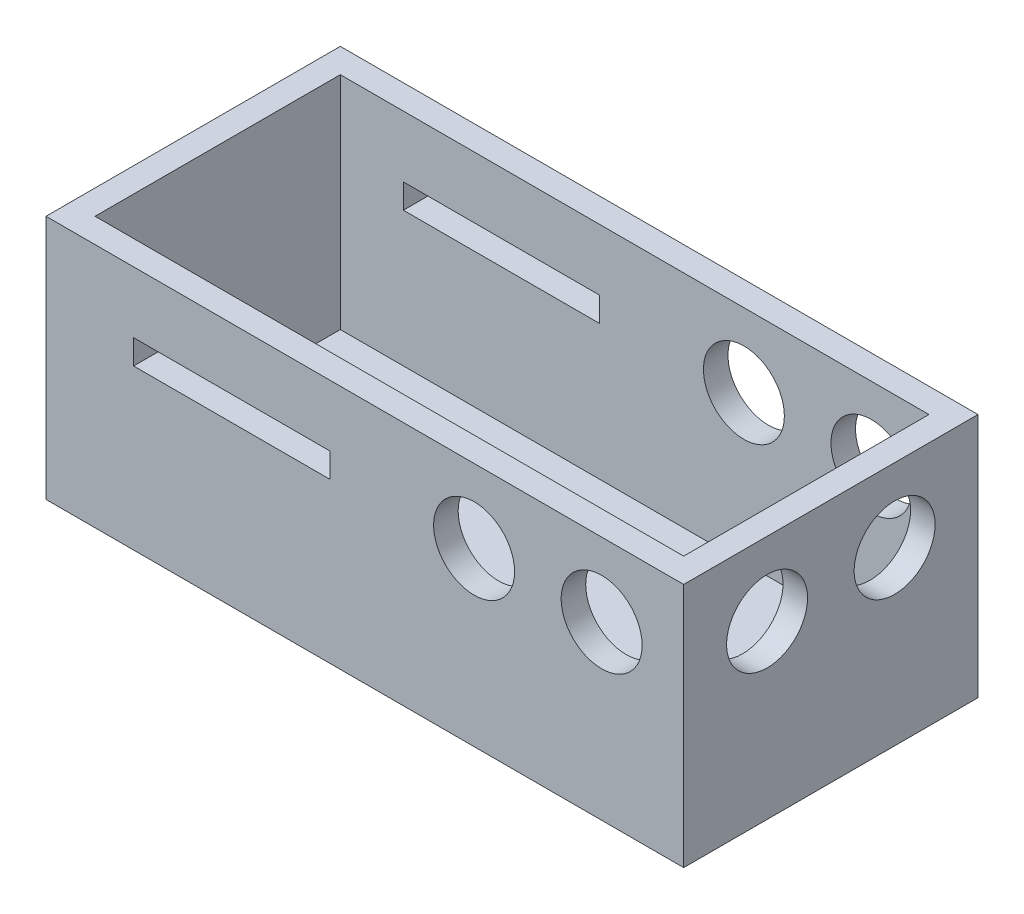
ISO-10303-21;
HEADER;
FILE_DESCRIPTION(('STEP AP214'),'2;1');
FILE_NAME('part.step','',(''),(''),'','','');
FILE_SCHEMA(('AUTOMOTIVE_DESIGN { 1 0 10303 214 1 1 1 1 }'));
ENDSEC;
DATA;
#1=APPLICATION_CONTEXT('core data for automotive mechanical design processes');
#2=APPLICATION_PROTOCOL_DEFINITION('international standard','automotive_design',2000,#1);
#3=PRODUCT_CONTEXT('',#1,'mechanical');
#4=PRODUCT('Part','Part','',(#3));
#5=PRODUCT_RELATED_PRODUCT_CATEGORY('part','',(#4));
#6=PRODUCT_DEFINITION_FORMATION('','',#4);
#7=PRODUCT_DEFINITION_CONTEXT('part definition',#1,'design');
#8=PRODUCT_DEFINITION('design','',#6,#7);
#9=PRODUCT_DEFINITION_SHAPE('','',#8);
#10=(LENGTH_UNIT() NAMED_UNIT(*) SI_UNIT(.MILLI.,.METRE.));
#11=(NAMED_UNIT(*) PLANE_ANGLE_UNIT() SI_UNIT($,.RADIAN.));
#12=(NAMED_UNIT(*) SI_UNIT($,.STERADIAN.) SOLID_ANGLE_UNIT());
#13=UNCERTAINTY_MEASURE_WITH_UNIT(LENGTH_MEASURE(1.E-05),#10,'distance_accuracy_value','');
#14=(GEOMETRIC_REPRESENTATION_CONTEXT(3) GLOBAL_UNCERTAINTY_ASSIGNED_CONTEXT((#13)) GLOBAL_UNIT_ASSIGNED_CONTEXT((#10,
#11,#12)) REPRESENTATION_CONTEXT('',''));
#15=CARTESIAN_POINT('',(0.,0.,0.));
#16=DIRECTION('',(0.,0.,1.));
#17=DIRECTION('',(1.,0.,0.));
#18=AXIS2_PLACEMENT_3D('',#15,#16,#17);
#19=CARTESIAN_POINT('',(-65.,50.,30.));
#20=DIRECTION('',(1.,0.,0.));
#21=DIRECTION('',(0.,0.,-1.));
#22=AXIS2_PLACEMENT_3D('',#19,#20,#21);
#23=PLANE('',#22);
#24=DIRECTION('',(0.,0.,1.));
#25=VECTOR('',#24,1.);
#26=CARTESIAN_POINT('',(-65.,0.,30.));
#27=LINE('',#26,#25);
#28=CARTESIAN_POINT('',(-65.,0.,-30.));
#29=VERTEX_POINT('',#28);
#30=CARTESIAN_POINT('',(-65.,0.,30.));
#31=VERTEX_POINT('',#30);
#32=EDGE_CURVE('E238',#29,#31,#27,.T.);
#33=ORIENTED_EDGE('',*,*,#32,.T.);
#34=DIRECTION('',(0.,-1.,0.));
#35=VECTOR('',#34,1.);
#36=CARTESIAN_POINT('',(-65.,50.,30.));
#37=LINE('',#36,#35);
#38=CARTESIAN_POINT('',(-65.,50.,30.));
#39=VERTEX_POINT('',#38);
#40=EDGE_CURVE('E288',#39,#31,#37,.T.);
#41=ORIENTED_EDGE('',*,*,#40,.F.);
#42=DIRECTION('',(0.,0.,1.));
#43=VECTOR('',#42,1.);
#44=CARTESIAN_POINT('',(-65.,50.,30.));
#45=LINE('',#44,#43);
#46=CARTESIAN_POINT('',(-65.,50.,-30.));
#47=VERTEX_POINT('',#46);
#48=EDGE_CURVE('E262',#47,#39,#45,.T.);
#49=ORIENTED_EDGE('',*,*,#48,.F.);
#50=DIRECTION('',(0.,-1.,0.));
#51=VECTOR('',#50,1.);
#52=CARTESIAN_POINT('',(-65.,50.,-30.));
#53=LINE('',#52,#51);
#54=EDGE_CURVE('E272',#47,#29,#53,.T.);
#55=ORIENTED_EDGE('',*,*,#54,.T.);
#56=EDGE_LOOP('',(#33,#41,#49,#55));
#57=FACE_BOUND('',#56,.T.);
#58=ADVANCED_FACE('F33',(#57),#23,.F.);
#59=CARTESIAN_POINT('',(65.,50.,30.));
#60=DIRECTION('',(0.,0.,-1.));
#61=DIRECTION('',(-1.,0.,0.));
#62=AXIS2_PLACEMENT_3D('',#59,#60,#61);
#63=PLANE('',#62);
#64=DIRECTION('',(1.,0.,0.));
#65=VECTOR('',#64,1.);
#66=CARTESIAN_POINT('',(-7.14067208269808,37.5,30.));
#67=LINE('',#66,#65);
#68=CARTESIAN_POINT('',(-47.1406720826981,37.5,30.));
#69=VERTEX_POINT('',#68);
#70=CARTESIAN_POINT('',(-7.14067208269808,37.5,30.));
#71=VERTEX_POINT('',#70);
#72=EDGE_CURVE('E169',#69,#71,#67,.T.);
#73=ORIENTED_EDGE('',*,*,#72,.T.);
#74=DIRECTION('',(0.,-1.,0.));
#75=VECTOR('',#74,1.);
#76=CARTESIAN_POINT('',(-7.14067208269808,37.5,30.));
#77=LINE('',#76,#75);
#78=CARTESIAN_POINT('',(-7.14067208269808,32.5,30.));
#79=VERTEX_POINT('',#78);
#80=EDGE_CURVE('E151',#71,#79,#77,.T.);
#81=ORIENTED_EDGE('',*,*,#80,.T.);
#82=DIRECTION('',(-1.,0.,0.));
#83=VECTOR('',#82,1.);
#84=CARTESIAN_POINT('',(-7.14067208269808,32.5,30.));
#85=LINE('',#84,#83);
#86=CARTESIAN_POINT('',(-47.1406720826981,32.5,30.));
#87=VERTEX_POINT('',#86);
#88=EDGE_CURVE('E161',#79,#87,#85,.T.);
#89=ORIENTED_EDGE('',*,*,#88,.T.);
#90=DIRECTION('',(0.,1.,0.));
#91=VECTOR('',#90,1.);
#92=CARTESIAN_POINT('',(-47.1406720826981,37.5,30.));
#93=LINE('',#92,#91);
#94=EDGE_CURVE('E47',#87,#69,#93,.T.);
#95=ORIENTED_EDGE('',*,*,#94,.T.);
#96=EDGE_LOOP('',(#73,#81,#89,#95));
#97=FACE_BOUND('',#96,.T.);
#98=CARTESIAN_POINT('',(48.2742436446079,35.,30.));
#99=DIRECTION('',(0.,0.,1.));
#100=DIRECTION('',(1.,0.,0.));
#101=AXIS2_PLACEMENT_3D('',#98,#99,#100);
#102=CIRCLE('',#101,8.25000000000001);
#103=CARTESIAN_POINT('',(56.5242436446079,35.,30.));
#104=VERTEX_POINT('',#103);
#105=EDGE_CURVE('E199',#104,#104,#102,.T.);
#106=ORIENTED_EDGE('',*,*,#105,.F.);
#107=EDGE_LOOP('',(#106));
#108=FACE_BOUND('',#107,.T.);
#109=CARTESIAN_POINT('',(22.2742436446078,35.,30.));
#110=DIRECTION('',(0.,0.,1.));
#111=DIRECTION('',(1.,0.,0.));
#112=AXIS2_PLACEMENT_3D('',#109,#110,#111);
#113=CIRCLE('',#112,8.25);
#114=CARTESIAN_POINT('',(30.5242436446078,35.,30.));
#115=VERTEX_POINT('',#114);
#116=EDGE_CURVE('E209',#115,#115,#113,.T.);
#117=ORIENTED_EDGE('',*,*,#116,.F.);
#118=EDGE_LOOP('',(#117));
#119=FACE_BOUND('',#118,.T.);
#120=DIRECTION('',(1.,0.,0.));
#121=VECTOR('',#120,1.);
#122=CARTESIAN_POINT('',(65.,0.,30.));
#123=LINE('',#122,#121);
#124=CARTESIAN_POINT('',(65.,0.,30.));
#125=VERTEX_POINT('',#124);
#126=EDGE_CURVE('E275',#31,#125,#123,.T.);
#127=ORIENTED_EDGE('',*,*,#126,.T.);
#128=DIRECTION('',(0.,-1.,0.));
#129=VECTOR('',#128,1.);
#130=CARTESIAN_POINT('',(65.,50.,30.));
#131=LINE('',#130,#129);
#132=CARTESIAN_POINT('',(65.,50.,30.));
#133=VERTEX_POINT('',#132);
#134=EDGE_CURVE('E285',#133,#125,#131,.T.);
#135=ORIENTED_EDGE('',*,*,#134,.F.);
#136=DIRECTION('',(1.,0.,0.));
#137=VECTOR('',#136,1.);
#138=CARTESIAN_POINT('',(65.,50.,30.));
#139=LINE('',#138,#137);
#140=EDGE_CURVE('E265',#39,#133,#139,.T.);
#141=ORIENTED_EDGE('',*,*,#140,.F.);
#142=ORIENTED_EDGE('',*,*,#40,.T.);
#143=EDGE_LOOP('',(#127,#135,#141,#142));
#144=FACE_BOUND('',#143,.T.);
#145=ADVANCED_FACE('F166',(#97,#108,#119,#144),#63,.F.);
#146=CARTESIAN_POINT('',(65.,50.,30.));
#147=DIRECTION('',(-1.,0.,0.));
#148=DIRECTION('',(0.,0.,1.));
#149=AXIS2_PLACEMENT_3D('',#146,#147,#148);
#150=PLANE('',#149);
#151=CARTESIAN_POINT('',(65.,35.,-13.));
#152=DIRECTION('',(1.,0.,0.));
#153=DIRECTION('',(0.,0.,-1.));
#154=AXIS2_PLACEMENT_3D('',#151,#152,#153);
#155=CIRCLE('',#154,8.25);
#156=CARTESIAN_POINT('',(65.,35.,-21.25));
#157=VERTEX_POINT('',#156);
#158=EDGE_CURVE('E220',#157,#157,#155,.T.);
#159=ORIENTED_EDGE('',*,*,#158,.F.);
#160=EDGE_LOOP('',(#159));
#161=FACE_BOUND('',#160,.T.);
#162=CARTESIAN_POINT('',(65.,35.,13.));
#163=DIRECTION('',(1.,0.,0.));
#164=DIRECTION('',(0.,0.,-1.));
#165=AXIS2_PLACEMENT_3D('',#162,#163,#164);
#166=CIRCLE('',#165,8.25);
#167=CARTESIAN_POINT('',(65.,35.,4.75));
#168=VERTEX_POINT('',#167);
#169=EDGE_CURVE('E226',#168,#168,#166,.T.);
#170=ORIENTED_EDGE('',*,*,#169,.F.);
#171=EDGE_LOOP('',(#170));
#172=FACE_BOUND('',#171,.T.);
#173=DIRECTION('',(0.,0.,-1.));
#174=VECTOR('',#173,1.);
#175=CARTESIAN_POINT('',(65.,0.,30.));
#176=LINE('',#175,#174);
#177=CARTESIAN_POINT('',(65.,0.,-30.));
#178=VERTEX_POINT('',#177);
#179=EDGE_CURVE('E277',#125,#178,#176,.T.);
#180=ORIENTED_EDGE('',*,*,#179,.T.);
#181=DIRECTION('',(0.,-1.,0.));
#182=VECTOR('',#181,1.);
#183=CARTESIAN_POINT('',(65.,50.,-30.));
#184=LINE('',#183,#182);
#185=CARTESIAN_POINT('',(65.,50.,-30.));
#186=VERTEX_POINT('',#185);
#187=EDGE_CURVE('E282',#186,#178,#184,.T.);
#188=ORIENTED_EDGE('',*,*,#187,.F.);
#189=DIRECTION('',(0.,0.,-1.));
#190=VECTOR('',#189,1.);
#191=CARTESIAN_POINT('',(65.,50.,30.));
#192=LINE('',#191,#190);
#193=EDGE_CURVE('E268',#133,#186,#192,.T.);
#194=ORIENTED_EDGE('',*,*,#193,.F.);
#195=ORIENTED_EDGE('',*,*,#134,.T.);
#196=EDGE_LOOP('',(#180,#188,#194,#195));
#197=FACE_BOUND('',#196,.T.);
#198=ADVANCED_FACE('F323',(#161,#172,#197),#150,.F.);
#199=CARTESIAN_POINT('',(65.,50.,-30.));
#200=DIRECTION('',(0.,0.,1.));
#201=DIRECTION('',(1.,0.,0.));
#202=AXIS2_PLACEMENT_3D('',#199,#200,#201);
#203=PLANE('',#202);
#204=DIRECTION('',(-1.,0.,0.));
#205=VECTOR('',#204,1.);
#206=CARTESIAN_POINT('',(-7.14067208269809,32.5,-30.));
#207=LINE('',#206,#205);
#208=CARTESIAN_POINT('',(-7.14067208269809,32.5,-30.));
#209=VERTEX_POINT('',#208);
#210=CARTESIAN_POINT('',(-47.1406720826981,32.5,-30.));
#211=VERTEX_POINT('',#210);
#212=EDGE_CURVE('E179',#209,#211,#207,.T.);
#213=ORIENTED_EDGE('',*,*,#212,.F.);
#214=DIRECTION('',(0.,-1.,0.));
#215=VECTOR('',#214,1.);
#216=CARTESIAN_POINT('',(-7.14067208269809,37.5,-30.));
#217=LINE('',#216,#215);
#218=CARTESIAN_POINT('',(-7.14067208269809,37.5,-30.));
#219=VERTEX_POINT('',#218);
#220=EDGE_CURVE('E55',#219,#209,#217,.T.);
#221=ORIENTED_EDGE('',*,*,#220,.F.);
#222=DIRECTION('',(1.,0.,0.));
#223=VECTOR('',#222,1.);
#224=CARTESIAN_POINT('',(-7.14067208269809,37.5,-30.));
#225=LINE('',#224,#223);
#226=CARTESIAN_POINT('',(-47.1406720826981,37.5,-30.));
#227=VERTEX_POINT('',#226);
#228=EDGE_CURVE('E170',#227,#219,#225,.T.);
#229=ORIENTED_EDGE('',*,*,#228,.F.);
#230=DIRECTION('',(0.,1.,0.));
#231=VECTOR('',#230,1.);
#232=CARTESIAN_POINT('',(-47.1406720826981,37.5,-30.));
#233=LINE('',#232,#231);
#234=EDGE_CURVE('E173',#211,#227,#233,.T.);
#235=ORIENTED_EDGE('',*,*,#234,.F.);
#236=EDGE_LOOP('',(#213,#221,#229,#235));
#237=FACE_BOUND('',#236,.T.);
#238=CARTESIAN_POINT('',(48.2742436446079,35.,-30.));
#239=DIRECTION('',(0.,0.,1.));
#240=DIRECTION('',(1.,0.,0.));
#241=AXIS2_PLACEMENT_3D('',#238,#239,#240);
#242=CIRCLE('',#241,8.25000000000001);
#243=CARTESIAN_POINT('',(56.5242436446079,35.,-30.));
#244=VERTEX_POINT('',#243);
#245=EDGE_CURVE('E200',#244,#244,#242,.T.);
#246=ORIENTED_EDGE('',*,*,#245,.T.);
#247=EDGE_LOOP('',(#246));
#248=FACE_BOUND('',#247,.T.);
#249=CARTESIAN_POINT('',(22.2742436446078,35.,-30.));
#250=DIRECTION('',(0.,0.,1.));
#251=DIRECTION('',(1.,0.,0.));
#252=AXIS2_PLACEMENT_3D('',#249,#250,#251);
#253=CIRCLE('',#252,8.25);
#254=CARTESIAN_POINT('',(30.5242436446078,35.,-30.));
#255=VERTEX_POINT('',#254);
#256=EDGE_CURVE('E210',#255,#255,#253,.T.);
#257=ORIENTED_EDGE('',*,*,#256,.T.);
#258=EDGE_LOOP('',(#257));
#259=FACE_BOUND('',#258,.T.);
#260=DIRECTION('',(-1.,0.,0.));
#261=VECTOR('',#260,1.);
#262=CARTESIAN_POINT('',(65.,0.,-30.));
#263=LINE('',#262,#261);
#264=EDGE_CURVE('E266',#178,#29,#263,.T.);
#265=ORIENTED_EDGE('',*,*,#264,.T.);
#266=ORIENTED_EDGE('',*,*,#54,.F.);
#267=DIRECTION('',(-1.,0.,0.));
#268=VECTOR('',#267,1.);
#269=CARTESIAN_POINT('',(65.,50.,-30.));
#270=LINE('',#269,#268);
#271=EDGE_CURVE('E270',#186,#47,#270,.T.);
#272=ORIENTED_EDGE('',*,*,#271,.F.);
#273=ORIENTED_EDGE('',*,*,#187,.T.);
#274=EDGE_LOOP('',(#265,#266,#272,#273));
#275=FACE_BOUND('',#274,.T.);
#276=ADVANCED_FACE('F319',(#237,#248,#259,#275),#203,.F.);
#277=CARTESIAN_POINT('',(0.,50.,0.));
#278=DIRECTION('',(0.,1.,0.));
#279=DIRECTION('',(0.,0.,1.));
#280=AXIS2_PLACEMENT_3D('',#277,#278,#279);
#281=PLANE('',#280);
#282=DIRECTION('',(0.,0.,1.));
#283=VECTOR('',#282,1.);
#284=CARTESIAN_POINT('',(-60.,50.,30.));
#285=LINE('',#284,#283);
#286=CARTESIAN_POINT('',(-60.,50.,-25.));
#287=VERTEX_POINT('',#286);
#288=CARTESIAN_POINT('',(-60.,50.,25.));
#289=VERTEX_POINT('',#288);
#290=EDGE_CURVE('E254',#287,#289,#285,.T.);
#291=ORIENTED_EDGE('',*,*,#290,.F.);
#292=DIRECTION('',(-1.,0.,0.));
#293=VECTOR('',#292,1.);
#294=CARTESIAN_POINT('',(65.,50.,-25.));
#295=LINE('',#294,#293);
#296=CARTESIAN_POINT('',(60.,50.,-25.));
#297=VERTEX_POINT('',#296);
#298=EDGE_CURVE('E244',#297,#287,#295,.T.);
#299=ORIENTED_EDGE('',*,*,#298,.F.);
#300=DIRECTION('',(0.,0.,-1.));
#301=VECTOR('',#300,1.);
#302=CARTESIAN_POINT('',(60.,50.,30.));
#303=LINE('',#302,#301);
#304=CARTESIAN_POINT('',(60.,50.,25.));
#305=VERTEX_POINT('',#304);
#306=EDGE_CURVE('E258',#305,#297,#303,.T.);
#307=ORIENTED_EDGE('',*,*,#306,.F.);
#308=DIRECTION('',(1.,0.,0.));
#309=VECTOR('',#308,1.);
#310=CARTESIAN_POINT('',(65.,50.,25.));
#311=LINE('',#310,#309);
#312=EDGE_CURVE('E256',#289,#305,#311,.T.);
#313=ORIENTED_EDGE('',*,*,#312,.F.);
#314=EDGE_LOOP('',(#291,#299,#307,#313));
#315=FACE_BOUND('',#314,.T.);
#316=ORIENTED_EDGE('',*,*,#48,.T.);
#317=ORIENTED_EDGE('',*,*,#140,.T.);
#318=ORIENTED_EDGE('',*,*,#193,.T.);
#319=ORIENTED_EDGE('',*,*,#271,.T.);
#320=EDGE_LOOP('',(#316,#317,#318,#319));
#321=FACE_BOUND('',#320,.T.);
#322=ADVANCED_FACE('F322',(#315,#321),#281,.T.);
#323=CARTESIAN_POINT('',(0.,0.,0.));
#324=DIRECTION('',(0.,1.,0.));
#325=DIRECTION('',(0.,0.,1.));
#326=AXIS2_PLACEMENT_3D('',#323,#324,#325);
#327=PLANE('',#326);
#328=ORIENTED_EDGE('',*,*,#32,.F.);
#329=ORIENTED_EDGE('',*,*,#264,.F.);
#330=ORIENTED_EDGE('',*,*,#179,.F.);
#331=ORIENTED_EDGE('',*,*,#126,.F.);
#332=EDGE_LOOP('',(#328,#329,#330,#331));
#333=FACE_BOUND('',#332,.T.);
#334=ADVANCED_FACE('F339',(#333),#327,.F.);
#335=CARTESIAN_POINT('',(-60.,50.,30.));
#336=DIRECTION('',(1.,0.,0.));
#337=DIRECTION('',(0.,0.,-1.));
#338=AXIS2_PLACEMENT_3D('',#335,#336,#337);
#339=PLANE('',#338);
#340=DIRECTION('',(0.,0.,1.));
#341=VECTOR('',#340,1.);
#342=CARTESIAN_POINT('',(-60.,5.,30.));
#343=LINE('',#342,#341);
#344=CARTESIAN_POINT('',(-60.,5.,-25.));
#345=VERTEX_POINT('',#344);
#346=CARTESIAN_POINT('',(-60.,5.,25.));
#347=VERTEX_POINT('',#346);
#348=EDGE_CURVE('E229',#345,#347,#343,.T.);
#349=ORIENTED_EDGE('',*,*,#348,.F.);
#350=DIRECTION('',(0.,-1.,0.));
#351=VECTOR('',#350,1.);
#352=CARTESIAN_POINT('',(-60.,50.,-25.));
#353=LINE('',#352,#351);
#354=EDGE_CURVE('E240',#287,#345,#353,.T.);
#355=ORIENTED_EDGE('',*,*,#354,.F.);
#356=ORIENTED_EDGE('',*,*,#290,.T.);
#357=DIRECTION('',(0.,-1.,0.));
#358=VECTOR('',#357,1.);
#359=CARTESIAN_POINT('',(-60.,50.,25.));
#360=LINE('',#359,#358);
#361=EDGE_CURVE('E235',#289,#347,#360,.T.);
#362=ORIENTED_EDGE('',*,*,#361,.T.);
#363=EDGE_LOOP('',(#349,#355,#356,#362));
#364=FACE_BOUND('',#363,.T.);
#365=ADVANCED_FACE('F387',(#364),#339,.T.);
#366=CARTESIAN_POINT('',(65.,50.,25.));
#367=DIRECTION('',(0.,0.,-1.));
#368=DIRECTION('',(-1.,0.,0.));
#369=AXIS2_PLACEMENT_3D('',#366,#367,#368);
#370=PLANE('',#369);
#371=DIRECTION('',(0.,-1.,0.));
#372=VECTOR('',#371,1.);
#373=CARTESIAN_POINT('',(-7.14067208269809,50.,25.));
#374=LINE('',#373,#372);
#375=CARTESIAN_POINT('',(-7.14067208269808,37.5,25.));
#376=VERTEX_POINT('',#375);
#377=CARTESIAN_POINT('',(-7.14067208269809,32.5,25.));
#378=VERTEX_POINT('',#377);
#379=EDGE_CURVE('E154',#376,#378,#374,.T.);
#380=ORIENTED_EDGE('',*,*,#379,.F.);
#381=DIRECTION('',(1.,0.,0.));
#382=VECTOR('',#381,1.);
#383=CARTESIAN_POINT('',(65.,37.5,25.));
#384=LINE('',#383,#382);
#385=CARTESIAN_POINT('',(-47.1406720826981,37.5,25.));
#386=VERTEX_POINT('',#385);
#387=EDGE_CURVE('E196',#386,#376,#384,.T.);
#388=ORIENTED_EDGE('',*,*,#387,.F.);
#389=DIRECTION('',(0.,1.,0.));
#390=VECTOR('',#389,1.);
#391=CARTESIAN_POINT('',(-47.1406720826981,50.,25.));
#392=LINE('',#391,#390);
#393=CARTESIAN_POINT('',(-47.1406720826981,32.5,25.));
#394=VERTEX_POINT('',#393);
#395=EDGE_CURVE('E194',#394,#386,#392,.T.);
#396=ORIENTED_EDGE('',*,*,#395,.F.);
#397=DIRECTION('',(-1.,0.,0.));
#398=VECTOR('',#397,1.);
#399=CARTESIAN_POINT('',(65.,32.5,25.));
#400=LINE('',#399,#398);
#401=EDGE_CURVE('E186',#378,#394,#400,.T.);
#402=ORIENTED_EDGE('',*,*,#401,.F.);
#403=EDGE_LOOP('',(#380,#388,#396,#402));
#404=FACE_BOUND('',#403,.T.);
#405=CARTESIAN_POINT('',(48.2742436446079,35.,25.));
#406=DIRECTION('',(0.,0.,-1.));
#407=DIRECTION('',(-1.,0.,0.));
#408=AXIS2_PLACEMENT_3D('',#405,#406,#407);
#409=CIRCLE('',#408,8.25000000000001);
#410=CARTESIAN_POINT('',(40.0242436446078,35.,25.));
#411=VERTEX_POINT('',#410);
#412=EDGE_CURVE('E206',#411,#411,#409,.T.);
#413=ORIENTED_EDGE('',*,*,#412,.F.);
#414=EDGE_LOOP('',(#413));
#415=FACE_BOUND('',#414,.T.);
#416=CARTESIAN_POINT('',(22.2742436446078,35.,25.));
#417=DIRECTION('',(0.,0.,-1.));
#418=DIRECTION('',(-1.,0.,0.));
#419=AXIS2_PLACEMENT_3D('',#416,#417,#418);
#420=CIRCLE('',#419,8.25);
#421=CARTESIAN_POINT('',(14.0242436446078,35.,25.));
#422=VERTEX_POINT('',#421);
#423=EDGE_CURVE('E216',#422,#422,#420,.T.);
#424=ORIENTED_EDGE('',*,*,#423,.F.);
#425=EDGE_LOOP('',(#424));
#426=FACE_BOUND('',#425,.T.);
#427=DIRECTION('',(1.,0.,0.));
#428=VECTOR('',#427,1.);
#429=CARTESIAN_POINT('',(65.,5.,25.));
#430=LINE('',#429,#428);
#431=CARTESIAN_POINT('',(60.,5.,25.));
#432=VERTEX_POINT('',#431);
#433=EDGE_CURVE('E234',#347,#432,#430,.T.);
#434=ORIENTED_EDGE('',*,*,#433,.F.);
#435=ORIENTED_EDGE('',*,*,#361,.F.);
#436=ORIENTED_EDGE('',*,*,#312,.T.);
#437=DIRECTION('',(0.,-1.,0.));
#438=VECTOR('',#437,1.);
#439=CARTESIAN_POINT('',(60.,50.,25.));
#440=LINE('',#439,#438);
#441=EDGE_CURVE('E239',#305,#432,#440,.T.);
#442=ORIENTED_EDGE('',*,*,#441,.T.);
#443=EDGE_LOOP('',(#434,#435,#436,#442));
#444=FACE_BOUND('',#443,.T.);
#445=ADVANCED_FACE('F381',(#404,#415,#426,#444),#370,.T.);
#446=CARTESIAN_POINT('',(60.,50.,30.));
#447=DIRECTION('',(-1.,0.,0.));
#448=DIRECTION('',(0.,0.,1.));
#449=AXIS2_PLACEMENT_3D('',#446,#447,#448);
#450=PLANE('',#449);
#451=CARTESIAN_POINT('',(60.,35.,-13.));
#452=DIRECTION('',(-1.,0.,0.));
#453=DIRECTION('',(0.,0.,1.));
#454=AXIS2_PLACEMENT_3D('',#451,#452,#453);
#455=CIRCLE('',#454,8.25);
#456=CARTESIAN_POINT('',(60.,35.,-4.75));
#457=VERTEX_POINT('',#456);
#458=EDGE_CURVE('E219',#457,#457,#455,.F.);
#459=ORIENTED_EDGE('',*,*,#458,.T.);
#460=EDGE_LOOP('',(#459));
#461=FACE_BOUND('',#460,.T.);
#462=CARTESIAN_POINT('',(60.,35.,13.));
#463=DIRECTION('',(-1.,0.,0.));
#464=DIRECTION('',(0.,0.,1.));
#465=AXIS2_PLACEMENT_3D('',#462,#463,#464);
#466=CIRCLE('',#465,8.25);
#467=CARTESIAN_POINT('',(60.,35.,21.25));
#468=VERTEX_POINT('',#467);
#469=EDGE_CURVE('E223',#468,#468,#466,.F.);
#470=ORIENTED_EDGE('',*,*,#469,.T.);
#471=EDGE_LOOP('',(#470));
#472=FACE_BOUND('',#471,.T.);
#473=DIRECTION('',(0.,0.,-1.));
#474=VECTOR('',#473,1.);
#475=CARTESIAN_POINT('',(60.,5.,30.));
#476=LINE('',#475,#474);
#477=CARTESIAN_POINT('',(60.,5.,-25.));
#478=VERTEX_POINT('',#477);
#479=EDGE_CURVE('E246',#432,#478,#476,.T.);
#480=ORIENTED_EDGE('',*,*,#479,.F.);
#481=ORIENTED_EDGE('',*,*,#441,.F.);
#482=ORIENTED_EDGE('',*,*,#306,.T.);
#483=DIRECTION('',(0.,-1.,0.));
#484=VECTOR('',#483,1.);
#485=CARTESIAN_POINT('',(60.,50.,-25.));
#486=LINE('',#485,#484);
#487=EDGE_CURVE('E243',#297,#478,#486,.T.);
#488=ORIENTED_EDGE('',*,*,#487,.T.);
#489=EDGE_LOOP('',(#480,#481,#482,#488));
#490=FACE_BOUND('',#489,.T.);
#491=ADVANCED_FACE('F386',(#461,#472,#490),#450,.T.);
#492=CARTESIAN_POINT('',(65.,50.,-25.));
#493=DIRECTION('',(0.,0.,1.));
#494=DIRECTION('',(1.,0.,0.));
#495=AXIS2_PLACEMENT_3D('',#492,#493,#494);
#496=PLANE('',#495);
#497=DIRECTION('',(0.,1.,0.));
#498=VECTOR('',#497,1.);
#499=CARTESIAN_POINT('',(-7.14067208269809,50.,-25.));
#500=LINE('',#499,#498);
#501=CARTESIAN_POINT('',(-7.14067208269809,32.5,-25.));
#502=VERTEX_POINT('',#501);
#503=CARTESIAN_POINT('',(-7.14067208269809,37.5,-25.));
#504=VERTEX_POINT('',#503);
#505=EDGE_CURVE('E11',#502,#504,#500,.T.);
#506=ORIENTED_EDGE('',*,*,#505,.F.);
#507=DIRECTION('',(1.,0.,0.));
#508=VECTOR('',#507,1.);
#509=CARTESIAN_POINT('',(65.,32.5,-25.));
#510=LINE('',#509,#508);
#511=CARTESIAN_POINT('',(-47.1406720826981,32.5,-25.));
#512=VERTEX_POINT('',#511);
#513=EDGE_CURVE('E291',#512,#502,#510,.T.);
#514=ORIENTED_EDGE('',*,*,#513,.F.);
#515=DIRECTION('',(0.,-1.,0.));
#516=VECTOR('',#515,1.);
#517=CARTESIAN_POINT('',(-47.1406720826981,50.,-25.));
#518=LINE('',#517,#516);
#519=CARTESIAN_POINT('',(-47.1406720826981,37.5,-25.));
#520=VERTEX_POINT('',#519);
#521=EDGE_CURVE('E297',#520,#512,#518,.T.);
#522=ORIENTED_EDGE('',*,*,#521,.F.);
#523=DIRECTION('',(-1.,0.,0.));
#524=VECTOR('',#523,1.);
#525=CARTESIAN_POINT('',(65.,37.5,-25.));
#526=LINE('',#525,#524);
#527=EDGE_CURVE('E40',#504,#520,#526,.T.);
#528=ORIENTED_EDGE('',*,*,#527,.F.);
#529=EDGE_LOOP('',(#506,#514,#522,#528));
#530=FACE_BOUND('',#529,.T.);
#531=CARTESIAN_POINT('',(48.2742436446079,35.,-25.));
#532=DIRECTION('',(0.,0.,1.));
#533=DIRECTION('',(1.,0.,0.));
#534=AXIS2_PLACEMENT_3D('',#531,#532,#533);
#535=CIRCLE('',#534,8.25000000000001);
#536=CARTESIAN_POINT('',(56.5242436446079,35.,-25.));
#537=VERTEX_POINT('',#536);
#538=EDGE_CURVE('E203',#537,#537,#535,.T.);
#539=ORIENTED_EDGE('',*,*,#538,.F.);
#540=EDGE_LOOP('',(#539));
#541=FACE_BOUND('',#540,.T.);
#542=CARTESIAN_POINT('',(22.2742436446078,35.,-25.));
#543=DIRECTION('',(0.,0.,1.));
#544=DIRECTION('',(1.,0.,0.));
#545=AXIS2_PLACEMENT_3D('',#542,#543,#544);
#546=CIRCLE('',#545,8.25);
#547=CARTESIAN_POINT('',(30.5242436446078,35.,-25.));
#548=VERTEX_POINT('',#547);
#549=EDGE_CURVE('E213',#548,#548,#546,.T.);
#550=ORIENTED_EDGE('',*,*,#549,.F.);
#551=EDGE_LOOP('',(#550));
#552=FACE_BOUND('',#551,.T.);
#553=DIRECTION('',(-1.,0.,0.));
#554=VECTOR('',#553,1.);
#555=CARTESIAN_POINT('',(65.,5.,-25.));
#556=LINE('',#555,#554);
#557=EDGE_CURVE('E250',#478,#345,#556,.T.);
#558=ORIENTED_EDGE('',*,*,#557,.F.);
#559=ORIENTED_EDGE('',*,*,#487,.F.);
#560=ORIENTED_EDGE('',*,*,#298,.T.);
#561=ORIENTED_EDGE('',*,*,#354,.T.);
#562=EDGE_LOOP('',(#558,#559,#560,#561));
#563=FACE_BOUND('',#562,.T.);
#564=ADVANCED_FACE('F312',(#530,#541,#552,#563),#496,.T.);
#565=CARTESIAN_POINT('',(0.,5.,0.));
#566=DIRECTION('',(0.,1.,0.));
#567=DIRECTION('',(0.,0.,1.));
#568=AXIS2_PLACEMENT_3D('',#565,#566,#567);
#569=PLANE('',#568);
#570=ORIENTED_EDGE('',*,*,#348,.T.);
#571=ORIENTED_EDGE('',*,*,#433,.T.);
#572=ORIENTED_EDGE('',*,*,#479,.T.);
#573=ORIENTED_EDGE('',*,*,#557,.T.);
#574=EDGE_LOOP('',(#570,#571,#572,#573));
#575=FACE_BOUND('',#574,.T.);
#576=ADVANCED_FACE('F401',(#575),#569,.T.);
#577=CARTESIAN_POINT('',(-65.001,35.,13.));
#578=DIRECTION('',(1.,0.,0.));
#579=DIRECTION('',(0.,0.,-1.));
#580=AXIS2_PLACEMENT_3D('',#577,#578,#579);
#581=CYLINDRICAL_SURFACE('',#580,8.25);
#582=ORIENTED_EDGE('',*,*,#469,.F.);
#583=EDGE_LOOP('',(#582));
#584=FACE_BOUND('',#583,.T.);
#585=ORIENTED_EDGE('',*,*,#169,.T.);
#586=EDGE_LOOP('',(#585));
#587=FACE_BOUND('',#586,.T.);
#588=ADVANCED_FACE('F483',(#584,#587),#581,.F.);
#589=CARTESIAN_POINT('',(-65.001,35.,-13.));
#590=DIRECTION('',(1.,0.,0.));
#591=DIRECTION('',(0.,0.,-1.));
#592=AXIS2_PLACEMENT_3D('',#589,#590,#591);
#593=CYLINDRICAL_SURFACE('',#592,8.25);
#594=ORIENTED_EDGE('',*,*,#458,.F.);
#595=EDGE_LOOP('',(#594));
#596=FACE_BOUND('',#595,.T.);
#597=ORIENTED_EDGE('',*,*,#158,.T.);
#598=EDGE_LOOP('',(#597));
#599=FACE_BOUND('',#598,.T.);
#600=ADVANCED_FACE('F479',(#596,#599),#593,.F.);
#601=CARTESIAN_POINT('',(22.2742436446078,35.,-30.));
#602=DIRECTION('',(0.,0.,1.));
#603=DIRECTION('',(1.,0.,0.));
#604=AXIS2_PLACEMENT_3D('',#601,#602,#603);
#605=CYLINDRICAL_SURFACE('',#604,8.25);
#606=ORIENTED_EDGE('',*,*,#549,.T.);
#607=EDGE_LOOP('',(#606));
#608=FACE_BOUND('',#607,.T.);
#609=ORIENTED_EDGE('',*,*,#256,.F.);
#610=EDGE_LOOP('',(#609));
#611=FACE_BOUND('',#610,.T.);
#612=ADVANCED_FACE('F476',(#608,#611),#605,.F.);
#613=ORIENTED_EDGE('',*,*,#423,.T.);
#614=EDGE_LOOP('',(#613));
#615=FACE_BOUND('',#614,.T.);
#616=ORIENTED_EDGE('',*,*,#116,.T.);
#617=EDGE_LOOP('',(#616));
#618=FACE_BOUND('',#617,.T.);
#619=ADVANCED_FACE('F474',(#615,#618),#605,.F.);
#620=CARTESIAN_POINT('',(48.2742436446079,35.,-30.));
#621=DIRECTION('',(0.,0.,1.));
#622=DIRECTION('',(1.,0.,0.));
#623=AXIS2_PLACEMENT_3D('',#620,#621,#622);
#624=CYLINDRICAL_SURFACE('',#623,8.25000000000001);
#625=ORIENTED_EDGE('',*,*,#538,.T.);
#626=EDGE_LOOP('',(#625));
#627=FACE_BOUND('',#626,.T.);
#628=ORIENTED_EDGE('',*,*,#245,.F.);
#629=EDGE_LOOP('',(#628));
#630=FACE_BOUND('',#629,.T.);
#631=ADVANCED_FACE('F471',(#627,#630),#624,.F.);
#632=ORIENTED_EDGE('',*,*,#412,.T.);
#633=EDGE_LOOP('',(#632));
#634=FACE_BOUND('',#633,.T.);
#635=ORIENTED_EDGE('',*,*,#105,.T.);
#636=EDGE_LOOP('',(#635));
#637=FACE_BOUND('',#636,.T.);
#638=ADVANCED_FACE('F368',(#634,#637),#624,.F.);
#639=CARTESIAN_POINT('',(-7.14067208269808,32.5,30.));
#640=DIRECTION('',(0.,-1.,0.));
#641=DIRECTION('',(0.,0.,-1.));
#642=AXIS2_PLACEMENT_3D('',#639,#640,#641);
#643=PLANE('',#642);
#644=ORIENTED_EDGE('',*,*,#513,.T.);
#645=DIRECTION('',(0.,0.,-1.));
#646=VECTOR('',#645,1.);
#647=CARTESIAN_POINT('',(-7.14067208269808,32.5,30.));
#648=LINE('',#647,#646);
#649=EDGE_CURVE('E158',#502,#209,#648,.T.);
#650=ORIENTED_EDGE('',*,*,#649,.T.);
#651=ORIENTED_EDGE('',*,*,#212,.T.);
#652=DIRECTION('',(0.,0.,-1.));
#653=VECTOR('',#652,1.);
#654=CARTESIAN_POINT('',(-47.1406720826981,32.5,30.));
#655=LINE('',#654,#653);
#656=EDGE_CURVE('E157',#512,#211,#655,.T.);
#657=ORIENTED_EDGE('',*,*,#656,.F.);
#658=EDGE_LOOP('',(#644,#650,#651,#657));
#659=FACE_BOUND('',#658,.T.);
#660=ADVANCED_FACE('F315',(#659),#643,.F.);
#661=CARTESIAN_POINT('',(-47.1406720826981,37.5,30.));
#662=DIRECTION('',(-1.,0.,0.));
#663=DIRECTION('',(0.,0.,1.));
#664=AXIS2_PLACEMENT_3D('',#661,#662,#663);
#665=PLANE('',#664);
#666=ORIENTED_EDGE('',*,*,#521,.T.);
#667=ORIENTED_EDGE('',*,*,#656,.T.);
#668=ORIENTED_EDGE('',*,*,#234,.T.);
#669=DIRECTION('',(0.,0.,-1.));
#670=VECTOR('',#669,1.);
#671=CARTESIAN_POINT('',(-47.1406720826981,37.5,30.));
#672=LINE('',#671,#670);
#673=EDGE_CURVE('E191',#520,#227,#672,.T.);
#674=ORIENTED_EDGE('',*,*,#673,.F.);
#675=EDGE_LOOP('',(#666,#667,#668,#674));
#676=FACE_BOUND('',#675,.T.);
#677=ADVANCED_FACE('F308',(#676),#665,.F.);
#678=CARTESIAN_POINT('',(-7.14067208269808,37.5,30.));
#679=DIRECTION('',(0.,1.,0.));
#680=DIRECTION('',(0.,0.,1.));
#681=AXIS2_PLACEMENT_3D('',#678,#679,#680);
#682=PLANE('',#681);
#683=ORIENTED_EDGE('',*,*,#527,.T.);
#684=ORIENTED_EDGE('',*,*,#673,.T.);
#685=ORIENTED_EDGE('',*,*,#228,.T.);
#686=DIRECTION('',(0.,0.,-1.));
#687=VECTOR('',#686,1.);
#688=CARTESIAN_POINT('',(-7.14067208269808,37.5,30.));
#689=LINE('',#688,#687);
#690=EDGE_CURVE('E187',#504,#219,#689,.T.);
#691=ORIENTED_EDGE('',*,*,#690,.F.);
#692=EDGE_LOOP('',(#683,#684,#685,#691));
#693=FACE_BOUND('',#692,.T.);
#694=ADVANCED_FACE('F303',(#693),#682,.F.);
#695=CARTESIAN_POINT('',(-7.14067208269808,37.5,30.));
#696=DIRECTION('',(1.,0.,0.));
#697=DIRECTION('',(0.,0.,-1.));
#698=AXIS2_PLACEMENT_3D('',#695,#696,#697);
#699=PLANE('',#698);
#700=ORIENTED_EDGE('',*,*,#505,.T.);
#701=ORIENTED_EDGE('',*,*,#690,.T.);
#702=ORIENTED_EDGE('',*,*,#220,.T.);
#703=ORIENTED_EDGE('',*,*,#649,.F.);
#704=EDGE_LOOP('',(#700,#701,#702,#703));
#705=FACE_BOUND('',#704,.T.);
#706=ADVANCED_FACE('F317',(#705),#699,.F.);
#707=ORIENTED_EDGE('',*,*,#379,.T.);
#708=EDGE_CURVE('E146',#79,#378,#648,.T.);
#709=ORIENTED_EDGE('',*,*,#708,.F.);
#710=ORIENTED_EDGE('',*,*,#80,.F.);
#711=EDGE_CURVE('E184',#71,#376,#689,.T.);
#712=ORIENTED_EDGE('',*,*,#711,.T.);
#713=EDGE_LOOP('',(#707,#709,#710,#712));
#714=FACE_BOUND('',#713,.T.);
#715=ADVANCED_FACE('F148',(#714),#699,.F.);
#716=ORIENTED_EDGE('',*,*,#387,.T.);
#717=ORIENTED_EDGE('',*,*,#711,.F.);
#718=ORIENTED_EDGE('',*,*,#72,.F.);
#719=EDGE_CURVE('E188',#69,#386,#672,.T.);
#720=ORIENTED_EDGE('',*,*,#719,.T.);
#721=EDGE_LOOP('',(#716,#717,#718,#720));
#722=FACE_BOUND('',#721,.T.);
#723=ADVANCED_FACE('F430',(#722),#682,.F.);
#724=ORIENTED_EDGE('',*,*,#395,.T.);
#725=ORIENTED_EDGE('',*,*,#719,.F.);
#726=ORIENTED_EDGE('',*,*,#94,.F.);
#727=EDGE_CURVE('E163',#87,#394,#655,.T.);
#728=ORIENTED_EDGE('',*,*,#727,.T.);
#729=EDGE_LOOP('',(#724,#725,#726,#728));
#730=FACE_BOUND('',#729,.T.);
#731=ADVANCED_FACE('F421',(#730),#665,.F.);
#732=ORIENTED_EDGE('',*,*,#401,.T.);
#733=ORIENTED_EDGE('',*,*,#727,.F.);
#734=ORIENTED_EDGE('',*,*,#88,.F.);
#735=ORIENTED_EDGE('',*,*,#708,.T.);
#736=EDGE_LOOP('',(#732,#733,#734,#735));
#737=FACE_BOUND('',#736,.T.);
#738=ADVANCED_FACE('F162',(#737),#643,.F.);
#739=CLOSED_SHELL('',(#58,#145,#198,#276,#322,#334,#365,#445,#491,#564,#576,#588,#600,#612,#619,
#631,#638,#660,#677,#694,#706,#715,#723,#731,#738));
#740=MANIFOLD_SOLID_BREP('B2',#739);
#741=ADVANCED_BREP_SHAPE_REPRESENTATION('',(#18,#740),#14);
#742=SHAPE_DEFINITION_REPRESENTATION(#9,#741);
ENDSEC;
END-ISO-10303-21;
